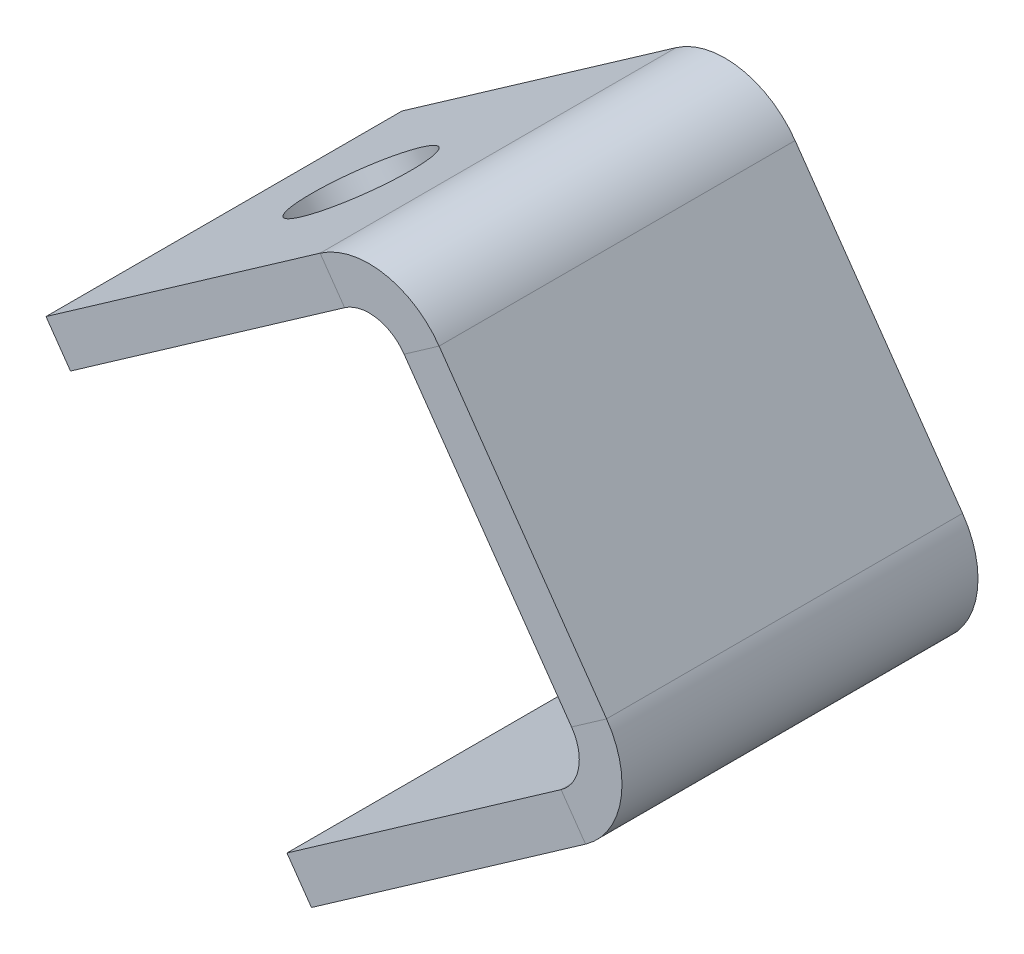
ISO-10303-21;
HEADER;
FILE_DESCRIPTION(('STEP AP214'),'2;1');
FILE_NAME('part.step','',(''),(''),'','','');
FILE_SCHEMA(('AUTOMOTIVE_DESIGN { 1 0 10303 214 1 1 1 1 }'));
ENDSEC;
DATA;
#1=APPLICATION_CONTEXT('core data for automotive mechanical design processes');
#2=APPLICATION_PROTOCOL_DEFINITION('international standard','automotive_design',2000,#1);
#3=PRODUCT_CONTEXT('',#1,'mechanical');
#4=PRODUCT('Part','Part','',(#3));
#5=PRODUCT_RELATED_PRODUCT_CATEGORY('part','',(#4));
#6=PRODUCT_DEFINITION_FORMATION('','',#4);
#7=PRODUCT_DEFINITION_CONTEXT('part definition',#1,'design');
#8=PRODUCT_DEFINITION('design','',#6,#7);
#9=PRODUCT_DEFINITION_SHAPE('','',#8);
#10=(LENGTH_UNIT() NAMED_UNIT(*) SI_UNIT(.MILLI.,.METRE.));
#11=(NAMED_UNIT(*) PLANE_ANGLE_UNIT() SI_UNIT($,.RADIAN.));
#12=(NAMED_UNIT(*) SI_UNIT($,.STERADIAN.) SOLID_ANGLE_UNIT());
#13=UNCERTAINTY_MEASURE_WITH_UNIT(LENGTH_MEASURE(1.E-05),#10,'distance_accuracy_value','');
#14=(GEOMETRIC_REPRESENTATION_CONTEXT(3) GLOBAL_UNCERTAINTY_ASSIGNED_CONTEXT((#13)) GLOBAL_UNIT_ASSIGNED_CONTEXT((#10,
#11,#12)) REPRESENTATION_CONTEXT('',''));
#15=CARTESIAN_POINT('',(0.,0.,0.));
#16=DIRECTION('',(0.,0.,1.));
#17=DIRECTION('',(1.,0.,0.));
#18=AXIS2_PLACEMENT_3D('',#15,#16,#17);
#19=CARTESIAN_POINT('',(159.327566169056,-20.8866770758818,140.456039210998));
#20=DIRECTION('',(-0.819152044288993,-0.573576436351044,0.));
#21=DIRECTION('',(0.,0.,-1.));
#22=AXIS2_PLACEMENT_3D('',#19,#20,#21);
#23=PLANE('',#22);
#24=DIRECTION('',(0.573576436351044,-0.819152044288993,0.));
#25=VECTOR('',#24,1.);
#26=CARTESIAN_POINT('',(159.327566169056,-20.8866770758818,25.));
#27=LINE('',#26,#25);
#28=CARTESIAN_POINT('',(155.88610755095,-15.9717648101479,25.));
#29=VERTEX_POINT('',#28);
#30=CARTESIAN_POINT('',(159.327566169056,-20.8866770758818,25.));
#31=VERTEX_POINT('',#30);
#32=EDGE_CURVE('E11',#29,#31,#27,.T.);
#33=ORIENTED_EDGE('',*,*,#32,.F.);
#34=DIRECTION('',(0.,0.,1.));
#35=VECTOR('',#34,1.);
#36=CARTESIAN_POINT('',(155.88610755095,-15.9717648101479,140.456039210998));
#37=LINE('',#36,#35);
#38=CARTESIAN_POINT('',(155.88610755095,-15.9717648101479,-25.0000000000001));
#39=VERTEX_POINT('',#38);
#40=EDGE_CURVE('E138',#29,#39,#37,.F.);
#41=ORIENTED_EDGE('',*,*,#40,.T.);
#42=DIRECTION('',(0.573576436351044,-0.819152044288993,0.));
#43=VECTOR('',#42,1.);
#44=CARTESIAN_POINT('',(159.327566169056,-20.8866770758818,-25.));
#45=LINE('',#44,#43);
#46=CARTESIAN_POINT('',(159.327566169056,-20.8866770758818,-25.));
#47=VERTEX_POINT('',#46);
#48=EDGE_CURVE('E51',#39,#47,#45,.T.);
#49=ORIENTED_EDGE('',*,*,#48,.T.);
#50=DIRECTION('',(0.,0.,-1.));
#51=VECTOR('',#50,1.);
#52=CARTESIAN_POINT('',(159.327566169056,-20.8866770758818,140.456039210998));
#53=LINE('',#52,#51);
#54=EDGE_CURVE('E227',#31,#47,#53,.T.);
#55=ORIENTED_EDGE('',*,*,#54,.F.);
#56=EDGE_LOOP('',(#33,#41,#49,#55));
#57=FACE_BOUND('',#56,.T.);
#58=ADVANCED_FACE('F40',(#57),#23,.T.);
#59=CARTESIAN_POINT('',(202.742624516373,9.51287405072353,-25.));
#60=DIRECTION('',(0.,0.,1.));
#61=DIRECTION('',(-0.819152044288993,-0.573576436351044,0.));
#62=AXIS2_PLACEMENT_3D('',#59,#60,#61);
#63=PLANE('',#62);
#64=ORIENTED_EDGE('',*,*,#48,.F.);
#65=DIRECTION('',(0.819152044288993,0.573576436351044,0.));
#66=VECTOR('',#65,1.);
#67=CARTESIAN_POINT('',(199.301165898267,14.4277863164576,-25.0000000000001));
#68=LINE('',#67,#66);
#69=CARTESIAN_POINT('',(194.386253632533,10.9863276983512,-25.));
#70=VERTEX_POINT('',#69);
#71=EDGE_CURVE('E145',#70,#39,#68,.F.);
#72=ORIENTED_EDGE('',*,*,#71,.F.);
#73=DIRECTION('',(0.573576436351045,-0.819152044288993,0.));
#74=VECTOR('',#73,1.);
#75=CARTESIAN_POINT('',(197.827712250639,6.07141543261726,-25.));
#76=LINE('',#75,#74);
#77=CARTESIAN_POINT('',(197.827712250639,6.07141543261726,-25.));
#78=VERTEX_POINT('',#77);
#79=EDGE_CURVE('E59',#70,#78,#76,.T.);
#80=ORIENTED_EDGE('',*,*,#79,.T.);
#81=DIRECTION('',(-0.819152044288993,-0.573576436351044,0.));
#82=VECTOR('',#81,1.);
#83=CARTESIAN_POINT('',(202.742624516373,9.51287405072353,-25.));
#84=LINE('',#83,#82);
#85=EDGE_CURVE('E230',#78,#47,#84,.T.);
#86=ORIENTED_EDGE('',*,*,#85,.T.);
#87=EDGE_LOOP('',(#64,#72,#80,#86));
#88=FACE_BOUND('',#87,.T.);
#89=ADVANCED_FACE('F234',(#88),#63,.F.);
#90=CARTESIAN_POINT('',(190.944795014427,15.9012399640852,-25.));
#91=DIRECTION('',(0.,0.,1.));
#92=DIRECTION('',(1.,0.,0.));
#93=AXIS2_PLACEMENT_3D('',#90,#91,#92);
#94=PLANE('',#93);
#95=ORIENTED_EDGE('',*,*,#79,.F.);
#96=CARTESIAN_POINT('',(190.944795014427,15.9012399640852,-25.));
#97=DIRECTION('',(0.,0.,-1.));
#98=DIRECTION('',(-1.,0.,0.));
#99=AXIS2_PLACEMENT_3D('',#96,#97,#98);
#100=CIRCLE('',#99,6.);
#101=CARTESIAN_POINT('',(195.85970728016,19.3426985821914,-25.));
#102=VERTEX_POINT('',#101);
#103=EDGE_CURVE('E131',#102,#70,#100,.T.);
#104=ORIENTED_EDGE('',*,*,#103,.F.);
#105=DIRECTION('',(0.819152044288993,0.573576436351044,0.));
#106=VECTOR('',#105,1.);
#107=CARTESIAN_POINT('',(200.774619545894,22.7841572002977,-25.0000000000001));
#108=LINE('',#107,#106);
#109=CARTESIAN_POINT('',(200.774619545894,22.7841572002977,-25.0000000000001));
#110=VERTEX_POINT('',#109);
#111=EDGE_CURVE('E218',#102,#110,#108,.T.);
#112=ORIENTED_EDGE('',*,*,#111,.T.);
#113=CARTESIAN_POINT('',(190.944795014427,15.9012399640852,-25.));
#114=DIRECTION('',(0.,0.,-1.));
#115=DIRECTION('',(-1.,0.,0.));
#116=AXIS2_PLACEMENT_3D('',#113,#114,#115);
#117=CIRCLE('',#116,12.);
#118=EDGE_CURVE('E120',#110,#78,#117,.T.);
#119=ORIENTED_EDGE('',*,*,#118,.T.);
#120=EDGE_LOOP('',(#95,#104,#112,#119));
#121=FACE_BOUND('',#120,.T.);
#122=ADVANCED_FACE('F269',(#121),#94,.F.);
#123=CARTESIAN_POINT('',(173.816527037395,61.2843032818804,-25.));
#124=DIRECTION('',(0.,0.,1.));
#125=DIRECTION('',(0.573576436351045,-0.819152044288993,0.));
#126=AXIS2_PLACEMENT_3D('',#123,#124,#125);
#127=PLANE('',#126);
#128=ORIENTED_EDGE('',*,*,#111,.F.);
#129=DIRECTION('',(-0.573576436351045,0.819152044288993,0.));
#130=VECTOR('',#129,1.);
#131=CARTESIAN_POINT('',(168.901614771661,57.8428446637741,-25.));
#132=LINE('',#131,#130);
#133=CARTESIAN_POINT('',(172.343073389768,52.9279323980402,-25.));
#134=VERTEX_POINT('',#133);
#135=EDGE_CURVE('E167',#134,#102,#132,.F.);
#136=ORIENTED_EDGE('',*,*,#135,.F.);
#137=DIRECTION('',(0.819152044288993,0.573576436351045,0.));
#138=VECTOR('',#137,1.);
#139=CARTESIAN_POINT('',(177.257985655502,56.3693910161464,-25.));
#140=LINE('',#139,#138);
#141=CARTESIAN_POINT('',(177.257985655502,56.3693910161464,-25.));
#142=VERTEX_POINT('',#141);
#143=EDGE_CURVE('E214',#134,#142,#140,.T.);
#144=ORIENTED_EDGE('',*,*,#143,.T.);
#145=DIRECTION('',(0.573576436351045,-0.819152044288993,0.));
#146=VECTOR('',#145,1.);
#147=CARTESIAN_POINT('',(173.816527037395,61.2843032818804,-25.));
#148=LINE('',#147,#146);
#149=EDGE_CURVE('E266',#142,#110,#148,.T.);
#150=ORIENTED_EDGE('',*,*,#149,.T.);
#151=EDGE_LOOP('',(#128,#136,#144,#150));
#152=FACE_BOUND('',#151,.T.);
#153=ADVANCED_FACE('F261',(#152),#127,.F.);
#154=CARTESIAN_POINT('',(167.428161124034,49.4864737799339,-25.));
#155=DIRECTION('',(0.,0.,1.));
#156=DIRECTION('',(1.,0.,0.));
#157=AXIS2_PLACEMENT_3D('',#154,#155,#156);
#158=PLANE('',#157);
#159=ORIENTED_EDGE('',*,*,#143,.F.);
#160=CARTESIAN_POINT('',(167.428161124034,49.4864737799339,-25.));
#161=DIRECTION('',(0.,0.,-1.));
#162=DIRECTION('',(-1.,0.,0.));
#163=AXIS2_PLACEMENT_3D('',#160,#161,#162);
#164=CIRCLE('',#163,6.);
#165=CARTESIAN_POINT('',(163.986702505927,54.4013860456678,-25.));
#166=VERTEX_POINT('',#165);
#167=EDGE_CURVE('E135',#166,#134,#164,.T.);
#168=ORIENTED_EDGE('',*,*,#167,.F.);
#169=DIRECTION('',(-0.573576436351044,0.819152044288993,0.));
#170=VECTOR('',#169,1.);
#171=CARTESIAN_POINT('',(160.545243887821,59.3162983114018,-25.));
#172=LINE('',#171,#170);
#173=CARTESIAN_POINT('',(160.545243887821,59.3162983114018,-25.));
#174=VERTEX_POINT('',#173);
#175=EDGE_CURVE('E210',#166,#174,#172,.T.);
#176=ORIENTED_EDGE('',*,*,#175,.T.);
#177=CARTESIAN_POINT('',(167.428161124034,49.4864737799339,-25.));
#178=DIRECTION('',(0.,0.,-1.));
#179=DIRECTION('',(-1.,0.,0.));
#180=AXIS2_PLACEMENT_3D('',#177,#178,#179);
#181=CIRCLE('',#180,12.);
#182=EDGE_CURVE('E333',#174,#142,#181,.T.);
#183=ORIENTED_EDGE('',*,*,#182,.T.);
#184=EDGE_LOOP('',(#159,#168,#176,#183));
#185=FACE_BOUND('',#184,.T.);
#186=ADVANCED_FACE('F593',(#185),#158,.F.);
#187=CARTESIAN_POINT('',(122.045097806238,32.3582058029027,-25.));
#188=DIRECTION('',(0.,0.,1.));
#189=DIRECTION('',(0.819152044288994,0.573576436351044,0.));
#190=AXIS2_PLACEMENT_3D('',#187,#188,#189);
#191=PLANE('',#190);
#192=ORIENTED_EDGE('',*,*,#175,.F.);
#193=DIRECTION('',(-0.819152044288993,-0.573576436351044,0.));
#194=VECTOR('',#193,1.);
#195=CARTESIAN_POINT('',(125.486556424345,27.4432935371688,-25.));
#196=LINE('',#195,#194);
#197=CARTESIAN_POINT('',(125.486556424345,27.4432935371688,-25.));
#198=VERTEX_POINT('',#197);
#199=EDGE_CURVE('E177',#198,#166,#196,.F.);
#200=ORIENTED_EDGE('',*,*,#199,.F.);
#201=DIRECTION('',(-0.573576436351044,0.819152044288993,0.));
#202=VECTOR('',#201,1.);
#203=CARTESIAN_POINT('',(122.045097806238,32.3582058029027,-25.));
#204=LINE('',#203,#202);
#205=CARTESIAN_POINT('',(122.045097806238,32.3582058029027,-25.));
#206=VERTEX_POINT('',#205);
#207=EDGE_CURVE('E206',#198,#206,#204,.T.);
#208=ORIENTED_EDGE('',*,*,#207,.T.);
#209=DIRECTION('',(0.819152044288994,0.573576436351044,0.));
#210=VECTOR('',#209,1.);
#211=CARTESIAN_POINT('',(122.045097806238,32.3582058029027,-25.));
#212=LINE('',#211,#210);
#213=EDGE_CURVE('E302',#206,#174,#212,.T.);
#214=ORIENTED_EDGE('',*,*,#213,.T.);
#215=EDGE_LOOP('',(#192,#200,#208,#214));
#216=FACE_BOUND('',#215,.T.);
#217=ADVANCED_FACE('F368',(#216),#191,.F.);
#218=CARTESIAN_POINT('',(122.045097806239,32.3582058029028,140.456039210998));
#219=DIRECTION('',(0.819152044288994,0.573576436351044,0.));
#220=DIRECTION('',(0.,0.,-1.));
#221=AXIS2_PLACEMENT_3D('',#218,#219,#220);
#222=PLANE('',#221);
#223=ORIENTED_EDGE('',*,*,#207,.F.);
#224=DIRECTION('',(0.,0.,1.));
#225=VECTOR('',#224,1.);
#226=CARTESIAN_POINT('',(125.486556424345,27.4432935371687,140.456039210998));
#227=LINE('',#226,#225);
#228=CARTESIAN_POINT('',(125.486556424345,27.4432935371688,25.));
#229=VERTEX_POINT('',#228);
#230=EDGE_CURVE('E172',#229,#198,#227,.F.);
#231=ORIENTED_EDGE('',*,*,#230,.F.);
#232=DIRECTION('',(-0.573576436351044,0.819152044288993,0.));
#233=VECTOR('',#232,1.);
#234=CARTESIAN_POINT('',(122.045097806238,32.3582058029027,25.));
#235=LINE('',#234,#233);
#236=CARTESIAN_POINT('',(122.045097806238,32.3582058029027,25.));
#237=VERTEX_POINT('',#236);
#238=EDGE_CURVE('E202',#229,#237,#235,.T.);
#239=ORIENTED_EDGE('',*,*,#238,.T.);
#240=DIRECTION('',(0.,0.,-1.));
#241=VECTOR('',#240,1.);
#242=CARTESIAN_POINT('',(122.045097806239,32.3582058029028,140.456039210998));
#243=LINE('',#242,#241);
#244=EDGE_CURVE('E290',#237,#206,#243,.T.);
#245=ORIENTED_EDGE('',*,*,#244,.T.);
#246=EDGE_LOOP('',(#223,#231,#239,#245));
#247=FACE_BOUND('',#246,.T.);
#248=ADVANCED_FACE('F289',(#247),#222,.F.);
#249=CARTESIAN_POINT('',(122.045097806239,32.3582058029028,25.));
#250=DIRECTION('',(0.,0.,-1.));
#251=DIRECTION('',(-0.819152044288994,-0.573576436351044,0.));
#252=AXIS2_PLACEMENT_3D('',#249,#250,#251);
#253=PLANE('',#252);
#254=ORIENTED_EDGE('',*,*,#238,.F.);
#255=DIRECTION('',(-0.819152044288993,-0.573576436351044,0.));
#256=VECTOR('',#255,1.);
#257=CARTESIAN_POINT('',(125.486556424345,27.4432935371688,25.));
#258=LINE('',#257,#256);
#259=CARTESIAN_POINT('',(163.986702505927,54.4013860456679,25.));
#260=VERTEX_POINT('',#259);
#261=EDGE_CURVE('E168',#260,#229,#258,.T.);
#262=ORIENTED_EDGE('',*,*,#261,.F.);
#263=DIRECTION('',(-0.573576436351042,0.819152044288995,0.));
#264=VECTOR('',#263,1.);
#265=CARTESIAN_POINT('',(160.545243887821,59.3162983114018,25.));
#266=LINE('',#265,#264);
#267=CARTESIAN_POINT('',(160.545243887821,59.3162983114018,25.));
#268=VERTEX_POINT('',#267);
#269=EDGE_CURVE('E198',#260,#268,#266,.T.);
#270=ORIENTED_EDGE('',*,*,#269,.T.);
#271=DIRECTION('',(-0.819152044288994,-0.573576436351044,0.));
#272=VECTOR('',#271,1.);
#273=CARTESIAN_POINT('',(122.045097806239,32.3582058029028,25.));
#274=LINE('',#273,#272);
#275=EDGE_CURVE('E299',#268,#237,#274,.T.);
#276=ORIENTED_EDGE('',*,*,#275,.T.);
#277=EDGE_LOOP('',(#254,#262,#270,#276));
#278=FACE_BOUND('',#277,.T.);
#279=ADVANCED_FACE('F305',(#278),#253,.F.);
#280=CARTESIAN_POINT('',(167.428161124034,49.4864737799339,25.));
#281=DIRECTION('',(0.,0.,-1.));
#282=DIRECTION('',(-1.,0.,0.));
#283=AXIS2_PLACEMENT_3D('',#280,#281,#282);
#284=PLANE('',#283);
#285=ORIENTED_EDGE('',*,*,#269,.F.);
#286=CARTESIAN_POINT('',(167.428161124034,49.4864737799339,25.));
#287=DIRECTION('',(0.,0.,-1.));
#288=DIRECTION('',(-1.,0.,0.));
#289=AXIS2_PLACEMENT_3D('',#286,#287,#288);
#290=CIRCLE('',#289,6.);
#291=CARTESIAN_POINT('',(172.343073389768,52.9279323980402,25.));
#292=VERTEX_POINT('',#291);
#293=EDGE_CURVE('E163',#292,#260,#290,.F.);
#294=ORIENTED_EDGE('',*,*,#293,.F.);
#295=DIRECTION('',(0.819152044288993,0.573576436351044,0.));
#296=VECTOR('',#295,1.);
#297=CARTESIAN_POINT('',(177.257985655502,56.3693910161465,24.9999999999999));
#298=LINE('',#297,#296);
#299=CARTESIAN_POINT('',(177.257985655502,56.3693910161465,24.9999999999999));
#300=VERTEX_POINT('',#299);
#301=EDGE_CURVE('E194',#292,#300,#298,.T.);
#302=ORIENTED_EDGE('',*,*,#301,.T.);
#303=CARTESIAN_POINT('',(167.428161124034,49.4864737799339,25.));
#304=DIRECTION('',(0.,0.,1.));
#305=DIRECTION('',(1.,0.,0.));
#306=AXIS2_PLACEMENT_3D('',#303,#304,#305);
#307=CIRCLE('',#306,12.);
#308=EDGE_CURVE('E330',#300,#268,#307,.T.);
#309=ORIENTED_EDGE('',*,*,#308,.T.);
#310=EDGE_LOOP('',(#285,#294,#302,#309));
#311=FACE_BOUND('',#310,.T.);
#312=ADVANCED_FACE('F362',(#311),#284,.F.);
#313=CARTESIAN_POINT('',(173.816527037395,61.2843032818804,24.9999999999999));
#314=DIRECTION('',(0.,0.,-1.));
#315=DIRECTION('',(-0.573576436351045,0.819152044288993,0.));
#316=AXIS2_PLACEMENT_3D('',#313,#314,#315);
#317=PLANE('',#316);
#318=ORIENTED_EDGE('',*,*,#301,.F.);
#319=DIRECTION('',(-0.573576436351045,0.819152044288993,0.));
#320=VECTOR('',#319,1.);
#321=CARTESIAN_POINT('',(168.901614771661,57.8428446637741,25.));
#322=LINE('',#321,#320);
#323=CARTESIAN_POINT('',(195.859707280161,19.3426985821914,25.));
#324=VERTEX_POINT('',#323);
#325=EDGE_CURVE('E157',#324,#292,#322,.T.);
#326=ORIENTED_EDGE('',*,*,#325,.F.);
#327=DIRECTION('',(0.819152044288994,0.573576436351043,0.));
#328=VECTOR('',#327,1.);
#329=CARTESIAN_POINT('',(200.774619545894,22.7841572002977,24.9999999999999));
#330=LINE('',#329,#328);
#331=CARTESIAN_POINT('',(200.774619545894,22.7841572002977,24.9999999999999));
#332=VERTEX_POINT('',#331);
#333=EDGE_CURVE('E119',#324,#332,#330,.T.);
#334=ORIENTED_EDGE('',*,*,#333,.T.);
#335=DIRECTION('',(-0.573576436351045,0.819152044288993,0.));
#336=VECTOR('',#335,1.);
#337=CARTESIAN_POINT('',(173.816527037395,61.2843032818804,24.9999999999999));
#338=LINE('',#337,#336);
#339=EDGE_CURVE('E320',#332,#300,#338,.T.);
#340=ORIENTED_EDGE('',*,*,#339,.T.);
#341=EDGE_LOOP('',(#318,#326,#334,#340));
#342=FACE_BOUND('',#341,.T.);
#343=ADVANCED_FACE('F359',(#342),#317,.F.);
#344=CARTESIAN_POINT('',(190.944795014427,15.9012399640852,25.));
#345=DIRECTION('',(0.,0.,-1.));
#346=DIRECTION('',(-1.,0.,0.));
#347=AXIS2_PLACEMENT_3D('',#344,#345,#346);
#348=PLANE('',#347);
#349=ORIENTED_EDGE('',*,*,#333,.F.);
#350=CARTESIAN_POINT('',(190.944795014427,15.9012399640852,25.));
#351=DIRECTION('',(0.,0.,-1.));
#352=DIRECTION('',(-1.,0.,0.));
#353=AXIS2_PLACEMENT_3D('',#350,#351,#352);
#354=CIRCLE('',#353,6.);
#355=CARTESIAN_POINT('',(194.386253632533,10.9863276983513,24.9999999999999));
#356=VERTEX_POINT('',#355);
#357=EDGE_CURVE('E128',#356,#324,#354,.F.);
#358=ORIENTED_EDGE('',*,*,#357,.F.);
#359=DIRECTION('',(0.573576436351044,-0.819152044288993,0.));
#360=VECTOR('',#359,1.);
#361=CARTESIAN_POINT('',(197.827712250639,6.07141543261739,24.9999999999999));
#362=LINE('',#361,#360);
#363=CARTESIAN_POINT('',(197.827712250639,6.07141543261739,24.9999999999999));
#364=VERTEX_POINT('',#363);
#365=EDGE_CURVE('E44',#356,#364,#362,.T.);
#366=ORIENTED_EDGE('',*,*,#365,.T.);
#367=CARTESIAN_POINT('',(190.944795014427,15.9012399640852,25.));
#368=DIRECTION('',(0.,0.,1.));
#369=DIRECTION('',(1.,0.,0.));
#370=AXIS2_PLACEMENT_3D('',#367,#368,#369);
#371=CIRCLE('',#370,12.);
#372=EDGE_CURVE('E236',#364,#332,#371,.T.);
#373=ORIENTED_EDGE('',*,*,#372,.T.);
#374=EDGE_LOOP('',(#349,#358,#366,#373));
#375=FACE_BOUND('',#374,.T.);
#376=ADVANCED_FACE('F141',(#375),#348,.F.);
#377=CARTESIAN_POINT('',(141.29517084703,45.8372520571523,0.));
#378=DIRECTION('',(-0.573576436351044,0.819152044288993,0.));
#379=DIRECTION('',(-0.819152044288993,-0.573576436351044,0.));
#380=AXIS2_PLACEMENT_3D('',#377,#378,#379);
#381=CYLINDRICAL_SURFACE('',#380,8.49999999999999);
#382=CARTESIAN_POINT('',(141.29517084703,45.8372520571523,0.));
#383=DIRECTION('',(-0.573576436351044,0.819152044288993,0.));
#384=DIRECTION('',(-0.819152044288993,-0.573576436351044,0.));
#385=AXIS2_PLACEMENT_3D('',#382,#383,#384);
#386=CIRCLE('',#385,8.49999999999999);
#387=CARTESIAN_POINT('',(134.332378470573,40.9618523481684,0.));
#388=VERTEX_POINT('',#387);
#389=EDGE_CURVE('E150',#388,#388,#386,.T.);
#390=ORIENTED_EDGE('',*,*,#389,.T.);
#391=EDGE_LOOP('',(#390));
#392=FACE_BOUND('',#391,.T.);
#393=CARTESIAN_POINT('',(144.736629465136,40.9223397914183,0.));
#394=DIRECTION('',(-0.573576436351044,0.819152044288993,0.));
#395=DIRECTION('',(-0.819152044288993,-0.573576436351044,0.));
#396=AXIS2_PLACEMENT_3D('',#393,#394,#395);
#397=CIRCLE('',#396,8.49999999999999);
#398=CARTESIAN_POINT('',(137.77383708868,36.0469400824344,0.));
#399=VERTEX_POINT('',#398);
#400=EDGE_CURVE('E176',#399,#399,#397,.T.);
#401=ORIENTED_EDGE('',*,*,#400,.F.);
#402=EDGE_LOOP('',(#401));
#403=FACE_BOUND('',#402,.T.);
#404=ADVANCED_FACE('F42',(#392,#403),#381,.F.);
#405=CARTESIAN_POINT('',(202.742624516373,9.51287405072354,25.));
#406=DIRECTION('',(0.,0.,-1.));
#407=DIRECTION('',(0.819152044288993,0.573576436351044,0.));
#408=AXIS2_PLACEMENT_3D('',#405,#406,#407);
#409=PLANE('',#408);
#410=DIRECTION('',(0.819152044288993,0.573576436351044,0.));
#411=VECTOR('',#410,1.);
#412=CARTESIAN_POINT('',(199.301165898267,14.4277863164575,25.));
#413=LINE('',#412,#411);
#414=EDGE_CURVE('E109',#29,#356,#413,.T.);
#415=ORIENTED_EDGE('',*,*,#414,.F.);
#416=ORIENTED_EDGE('',*,*,#32,.T.);
#417=DIRECTION('',(0.819152044288993,0.573576436351044,0.));
#418=VECTOR('',#417,1.);
#419=CARTESIAN_POINT('',(202.742624516373,9.51287405072354,25.));
#420=LINE('',#419,#418);
#421=EDGE_CURVE('E112',#31,#364,#420,.T.);
#422=ORIENTED_EDGE('',*,*,#421,.T.);
#423=ORIENTED_EDGE('',*,*,#365,.F.);
#424=EDGE_LOOP('',(#415,#416,#422,#423));
#425=FACE_BOUND('',#424,.T.);
#426=ADVANCED_FACE('F107',(#425),#409,.F.);
#427=CARTESIAN_POINT('',(190.944795014427,15.9012399640852,140.456039210998));
#428=DIRECTION('',(0.,0.,-1.));
#429=DIRECTION('',(-1.,0.,0.));
#430=AXIS2_PLACEMENT_3D('',#427,#428,#429);
#431=CYLINDRICAL_SURFACE('',#430,12.);
#432=DIRECTION('',(0.,0.,-1.));
#433=VECTOR('',#432,1.);
#434=CARTESIAN_POINT('',(200.774619545895,22.7841572002978,140.456039210998));
#435=LINE('',#434,#433);
#436=EDGE_CURVE('E324',#332,#110,#435,.T.);
#437=ORIENTED_EDGE('',*,*,#436,.F.);
#438=ORIENTED_EDGE('',*,*,#372,.F.);
#439=DIRECTION('',(0.,0.,-1.));
#440=VECTOR('',#439,1.);
#441=CARTESIAN_POINT('',(197.827712250639,6.07141543261729,140.456039210998));
#442=LINE('',#441,#440);
#443=EDGE_CURVE('E337',#364,#78,#442,.T.);
#444=ORIENTED_EDGE('',*,*,#443,.T.);
#445=ORIENTED_EDGE('',*,*,#118,.F.);
#446=EDGE_LOOP('',(#437,#438,#444,#445));
#447=FACE_BOUND('',#446,.T.);
#448=ADVANCED_FACE('F353',(#447),#431,.T.);
#449=CARTESIAN_POINT('',(202.742624516373,9.51287405072356,140.456039210998));
#450=DIRECTION('',(0.573576436351044,-0.819152044288993,0.));
#451=DIRECTION('',(0.819152044288993,0.573576436351044,0.));
#452=AXIS2_PLACEMENT_3D('',#449,#450,#451);
#453=PLANE('',#452);
#454=ORIENTED_EDGE('',*,*,#443,.F.);
#455=ORIENTED_EDGE('',*,*,#421,.F.);
#456=ORIENTED_EDGE('',*,*,#54,.T.);
#457=ORIENTED_EDGE('',*,*,#85,.F.);
#458=EDGE_LOOP('',(#454,#455,#456,#457));
#459=FACE_BOUND('',#458,.T.);
#460=ADVANCED_FACE('F229',(#459),#453,.T.);
#461=CARTESIAN_POINT('',(167.428161124034,49.4864737799339,140.456039210998));
#462=DIRECTION('',(0.,0.,-1.));
#463=DIRECTION('',(-1.,0.,0.));
#464=AXIS2_PLACEMENT_3D('',#461,#462,#463);
#465=CYLINDRICAL_SURFACE('',#464,12.);
#466=DIRECTION('',(0.,0.,-1.));
#467=VECTOR('',#466,1.);
#468=CARTESIAN_POINT('',(160.545243887821,59.3162983114018,140.456039210998));
#469=LINE('',#468,#467);
#470=EDGE_CURVE('E307',#268,#174,#469,.T.);
#471=ORIENTED_EDGE('',*,*,#470,.F.);
#472=ORIENTED_EDGE('',*,*,#308,.F.);
#473=DIRECTION('',(0.,0.,-1.));
#474=VECTOR('',#473,1.);
#475=CARTESIAN_POINT('',(177.257985655502,56.3693910161465,140.456039210998));
#476=LINE('',#475,#474);
#477=EDGE_CURVE('E316',#300,#142,#476,.T.);
#478=ORIENTED_EDGE('',*,*,#477,.T.);
#479=ORIENTED_EDGE('',*,*,#182,.F.);
#480=EDGE_LOOP('',(#471,#472,#478,#479));
#481=FACE_BOUND('',#480,.T.);
#482=ADVANCED_FACE('F365',(#481),#465,.T.);
#483=CARTESIAN_POINT('',(173.816527037395,61.2843032818804,140.456039210998));
#484=DIRECTION('',(0.819152044288993,0.573576436351044,0.));
#485=DIRECTION('',(-0.573576436351045,0.819152044288993,0.));
#486=AXIS2_PLACEMENT_3D('',#483,#484,#485);
#487=PLANE('',#486);
#488=ORIENTED_EDGE('',*,*,#477,.F.);
#489=ORIENTED_EDGE('',*,*,#339,.F.);
#490=ORIENTED_EDGE('',*,*,#436,.T.);
#491=ORIENTED_EDGE('',*,*,#149,.F.);
#492=EDGE_LOOP('',(#488,#489,#490,#491));
#493=FACE_BOUND('',#492,.T.);
#494=ADVANCED_FACE('F357',(#493),#487,.T.);
#495=CARTESIAN_POINT('',(122.045097806239,32.3582058029028,140.456039210998));
#496=DIRECTION('',(-0.573576436351044,0.819152044288993,0.));
#497=DIRECTION('',(-0.819152044288993,-0.573576436351044,0.));
#498=AXIS2_PLACEMENT_3D('',#495,#496,#497);
#499=PLANE('',#498);
#500=ORIENTED_EDGE('',*,*,#389,.F.);
#501=EDGE_LOOP('',(#500));
#502=FACE_BOUND('',#501,.T.);
#503=ORIENTED_EDGE('',*,*,#244,.F.);
#504=ORIENTED_EDGE('',*,*,#275,.F.);
#505=ORIENTED_EDGE('',*,*,#470,.T.);
#506=ORIENTED_EDGE('',*,*,#213,.F.);
#507=EDGE_LOOP('',(#503,#504,#505,#506));
#508=FACE_BOUND('',#507,.T.);
#509=ADVANCED_FACE('F297',(#502,#508),#499,.T.);
#510=CARTESIAN_POINT('',(190.944795014427,15.9012399640852,140.456039210998));
#511=DIRECTION('',(0.,0.,-1.));
#512=DIRECTION('',(-1.,0.,0.));
#513=AXIS2_PLACEMENT_3D('',#510,#511,#512);
#514=CYLINDRICAL_SURFACE('',#513,6.);
#515=DIRECTION('',(0.,0.,1.));
#516=VECTOR('',#515,1.);
#517=CARTESIAN_POINT('',(195.859707280161,19.3426985821915,140.456039210998));
#518=LINE('',#517,#516);
#519=EDGE_CURVE('E161',#324,#102,#518,.F.);
#520=ORIENTED_EDGE('',*,*,#519,.T.);
#521=ORIENTED_EDGE('',*,*,#103,.T.);
#522=DIRECTION('',(0.,0.,-1.));
#523=VECTOR('',#522,1.);
#524=CARTESIAN_POINT('',(194.386253632533,10.9863276983513,140.456039210998));
#525=LINE('',#524,#523);
#526=EDGE_CURVE('E125',#356,#70,#525,.T.);
#527=ORIENTED_EDGE('',*,*,#526,.F.);
#528=ORIENTED_EDGE('',*,*,#357,.T.);
#529=EDGE_LOOP('',(#520,#521,#527,#528));
#530=FACE_BOUND('',#529,.T.);
#531=ADVANCED_FACE('F127',(#530),#514,.F.);
#532=CARTESIAN_POINT('',(199.301165898267,14.4277863164575,140.456039210998));
#533=DIRECTION('',(0.573576436351044,-0.819152044288993,0.));
#534=DIRECTION('',(0.819152044288993,0.573576436351044,0.));
#535=AXIS2_PLACEMENT_3D('',#532,#533,#534);
#536=PLANE('',#535);
#537=ORIENTED_EDGE('',*,*,#526,.T.);
#538=ORIENTED_EDGE('',*,*,#71,.T.);
#539=ORIENTED_EDGE('',*,*,#40,.F.);
#540=ORIENTED_EDGE('',*,*,#414,.T.);
#541=EDGE_LOOP('',(#537,#538,#539,#540));
#542=FACE_BOUND('',#541,.T.);
#543=ADVANCED_FACE('F137',(#542),#536,.F.);
#544=CARTESIAN_POINT('',(167.428161124034,49.4864737799339,140.456039210998));
#545=DIRECTION('',(0.,0.,-1.));
#546=DIRECTION('',(-1.,0.,0.));
#547=AXIS2_PLACEMENT_3D('',#544,#545,#546);
#548=CYLINDRICAL_SURFACE('',#547,6.);
#549=DIRECTION('',(0.,0.,1.));
#550=VECTOR('',#549,1.);
#551=CARTESIAN_POINT('',(163.986702505927,54.4013860456678,140.456039210998));
#552=LINE('',#551,#550);
#553=EDGE_CURVE('E155',#260,#166,#552,.F.);
#554=ORIENTED_EDGE('',*,*,#553,.T.);
#555=ORIENTED_EDGE('',*,*,#167,.T.);
#556=DIRECTION('',(0.,0.,-1.));
#557=VECTOR('',#556,1.);
#558=CARTESIAN_POINT('',(172.343073389768,52.9279323980402,140.456039210998));
#559=LINE('',#558,#557);
#560=EDGE_CURVE('E162',#292,#134,#559,.T.);
#561=ORIENTED_EDGE('',*,*,#560,.F.);
#562=ORIENTED_EDGE('',*,*,#293,.T.);
#563=EDGE_LOOP('',(#554,#555,#561,#562));
#564=FACE_BOUND('',#563,.T.);
#565=ADVANCED_FACE('F257',(#564),#548,.F.);
#566=CARTESIAN_POINT('',(168.901614771661,57.8428446637741,140.456039210998));
#567=DIRECTION('',(0.819152044288993,0.573576436351044,0.));
#568=DIRECTION('',(-0.573576436351045,0.819152044288993,0.));
#569=AXIS2_PLACEMENT_3D('',#566,#567,#568);
#570=PLANE('',#569);
#571=ORIENTED_EDGE('',*,*,#560,.T.);
#572=ORIENTED_EDGE('',*,*,#135,.T.);
#573=ORIENTED_EDGE('',*,*,#519,.F.);
#574=ORIENTED_EDGE('',*,*,#325,.T.);
#575=EDGE_LOOP('',(#571,#572,#573,#574));
#576=FACE_BOUND('',#575,.T.);
#577=ADVANCED_FACE('F251',(#576),#570,.F.);
#578=CARTESIAN_POINT('',(125.486556424345,27.4432935371688,140.456039210998));
#579=DIRECTION('',(-0.573576436351044,0.819152044288993,0.));
#580=DIRECTION('',(-0.819152044288993,-0.573576436351044,0.));
#581=AXIS2_PLACEMENT_3D('',#578,#579,#580);
#582=PLANE('',#581);
#583=ORIENTED_EDGE('',*,*,#400,.T.);
#584=EDGE_LOOP('',(#583));
#585=FACE_BOUND('',#584,.T.);
#586=ORIENTED_EDGE('',*,*,#230,.T.);
#587=ORIENTED_EDGE('',*,*,#199,.T.);
#588=ORIENTED_EDGE('',*,*,#553,.F.);
#589=ORIENTED_EDGE('',*,*,#261,.T.);
#590=EDGE_LOOP('',(#586,#587,#588,#589));
#591=FACE_BOUND('',#590,.T.);
#592=ADVANCED_FACE('F371',(#585,#591),#582,.F.);
#593=CLOSED_SHELL('',(#58,#89,#122,#153,#186,#217,#248,#279,#312,#343,#376,#404,#426,#448,#460,
#482,#494,#509,#531,#543,#565,#577,#592));
#594=MANIFOLD_SOLID_BREP('B2',#593);
#595=ADVANCED_BREP_SHAPE_REPRESENTATION('',(#18,#594),#14);
#596=SHAPE_DEFINITION_REPRESENTATION(#9,#595);
ENDSEC;
END-ISO-10303-21;
